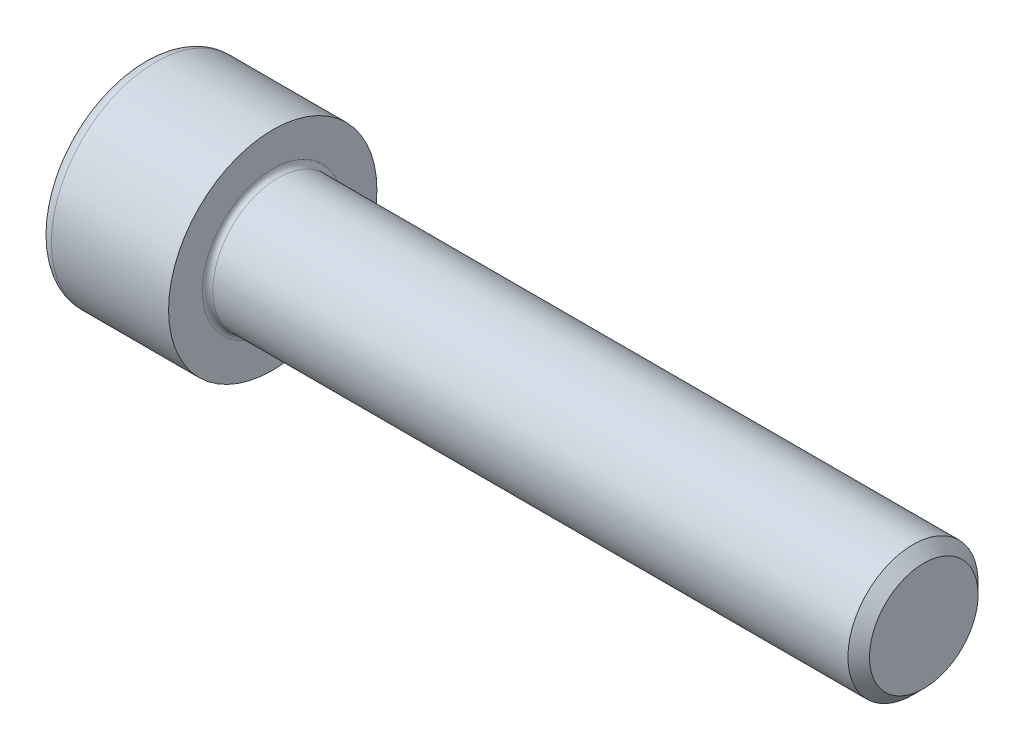
ISO-10303-21;
HEADER;
FILE_DESCRIPTION(('STEP AP214'),'2;1');
FILE_NAME('part.step','',(''),(''),'','','');
FILE_SCHEMA(('AUTOMOTIVE_DESIGN { 1 0 10303 214 1 1 1 1 }'));
ENDSEC;
DATA;
#1=APPLICATION_CONTEXT('core data for automotive mechanical design processes');
#2=APPLICATION_PROTOCOL_DEFINITION('international standard','automotive_design',2000,#1);
#3=PRODUCT_CONTEXT('',#1,'mechanical');
#4=PRODUCT('Part','Part','',(#3));
#5=PRODUCT_RELATED_PRODUCT_CATEGORY('part','',(#4));
#6=PRODUCT_DEFINITION_FORMATION('','',#4);
#7=PRODUCT_DEFINITION_CONTEXT('part definition',#1,'design');
#8=PRODUCT_DEFINITION('design','',#6,#7);
#9=PRODUCT_DEFINITION_SHAPE('','',#8);
#10=(LENGTH_UNIT() NAMED_UNIT(*) SI_UNIT(.MILLI.,.METRE.));
#11=(NAMED_UNIT(*) PLANE_ANGLE_UNIT() SI_UNIT($,.RADIAN.));
#12=(NAMED_UNIT(*) SI_UNIT($,.STERADIAN.) SOLID_ANGLE_UNIT());
#13=UNCERTAINTY_MEASURE_WITH_UNIT(LENGTH_MEASURE(1.E-05),#10,'distance_accuracy_value','');
#14=(GEOMETRIC_REPRESENTATION_CONTEXT(3) GLOBAL_UNCERTAINTY_ASSIGNED_CONTEXT((#13)) GLOBAL_UNIT_ASSIGNED_CONTEXT((#10,
#11,#12)) REPRESENTATION_CONTEXT('',''));
#15=CARTESIAN_POINT('',(0.,0.,0.));
#16=DIRECTION('',(0.,0.,1.));
#17=DIRECTION('',(1.,0.,0.));
#18=AXIS2_PLACEMENT_3D('',#15,#16,#17);
#19=CARTESIAN_POINT('',(0.,0.,0.));
#20=DIRECTION('',(-1.,0.,0.));
#21=DIRECTION('',(0.,0.,1.));
#22=AXIS2_PLACEMENT_3D('',#19,#20,#21);
#23=PLANE('',#22);
#24=DIRECTION('',(0.,-0.499999999999999,0.866025403784439));
#25=VECTOR('',#24,1.);
#26=CARTESIAN_POINT('',(0.,4.63323591024674,0.));
#27=LINE('',#26,#25);
#28=CARTESIAN_POINT('',(0.,4.63323591024674,0.));
#29=VERTEX_POINT('',#28);
#30=CARTESIAN_POINT('',(0.,2.31661795512338,4.01249999999999));
#31=VERTEX_POINT('',#30);
#32=EDGE_CURVE('E287',#29,#31,#27,.T.);
#33=ORIENTED_EDGE('',*,*,#32,.T.);
#34=DIRECTION('',(0.,1.,0.));
#35=VECTOR('',#34,1.);
#36=CARTESIAN_POINT('',(0.,-2.31661795512337,4.0125));
#37=LINE('',#36,#35);
#38=CARTESIAN_POINT('',(0.,-2.31661795512337,4.0125));
#39=VERTEX_POINT('',#38);
#40=EDGE_CURVE('E141',#39,#31,#37,.T.);
#41=ORIENTED_EDGE('',*,*,#40,.F.);
#42=DIRECTION('',(0.,-0.500000000000001,-0.866025403784438));
#43=VECTOR('',#42,1.);
#44=CARTESIAN_POINT('',(0.,-2.31661795512337,4.0125));
#45=LINE('',#44,#43);
#46=CARTESIAN_POINT('',(0.,-4.63323591024675,0.));
#47=VERTEX_POINT('',#46);
#48=EDGE_CURVE('E292',#39,#47,#45,.T.);
#49=ORIENTED_EDGE('',*,*,#48,.T.);
#50=DIRECTION('',(0.,0.499999999999998,-0.86602540378444));
#51=VECTOR('',#50,1.);
#52=CARTESIAN_POINT('',(0.,-4.63323591024675,0.));
#53=LINE('',#52,#51);
#54=CARTESIAN_POINT('',(0.,-2.31661795512338,-4.0125));
#55=VERTEX_POINT('',#54);
#56=EDGE_CURVE('E296',#47,#55,#53,.T.);
#57=ORIENTED_EDGE('',*,*,#56,.T.);
#58=DIRECTION('',(0.,-1.,0.));
#59=VECTOR('',#58,1.);
#60=CARTESIAN_POINT('',(0.,2.31661795512336,-4.0125));
#61=LINE('',#60,#59);
#62=CARTESIAN_POINT('',(0.,2.31661795512336,-4.0125));
#63=VERTEX_POINT('',#62);
#64=EDGE_CURVE('E300',#63,#55,#61,.T.);
#65=ORIENTED_EDGE('',*,*,#64,.F.);
#66=DIRECTION('',(0.,-0.500000000000001,-0.866025403784438));
#67=VECTOR('',#66,1.);
#68=CARTESIAN_POINT('',(0.,4.63323591024674,0.));
#69=LINE('',#68,#67);
#70=EDGE_CURVE('E136',#29,#63,#69,.T.);
#71=ORIENTED_EDGE('',*,*,#70,.F.);
#72=EDGE_LOOP('',(#33,#41,#49,#57,#65,#71));
#73=FACE_BOUND('',#72,.T.);
#74=CARTESIAN_POINT('',(0.,0.,0.));
#75=DIRECTION('',(-1.,0.,0.));
#76=DIRECTION('',(0.,0.,1.));
#77=AXIS2_PLACEMENT_3D('',#74,#75,#76);
#78=CIRCLE('',#77,7.);
#79=CARTESIAN_POINT('',(0.,0.,7.));
#80=VERTEX_POINT('',#79);
#81=EDGE_CURVE('E51',#80,#80,#78,.T.);
#82=ORIENTED_EDGE('',*,*,#81,.T.);
#83=EDGE_LOOP('',(#82));
#84=FACE_BOUND('',#83,.T.);
#85=ADVANCED_FACE('F42',(#73,#84),#23,.T.);
#86=CARTESIAN_POINT('',(-31.75,0.,0.));
#87=DIRECTION('',(-1.,0.,0.));
#88=DIRECTION('',(0.,0.,1.));
#89=AXIS2_PLACEMENT_3D('',#86,#87,#88);
#90=CYLINDRICAL_SURFACE('',#89,8.);
#91=CARTESIAN_POINT('',(1.,0.,0.));
#92=DIRECTION('',(-1.,0.,0.));
#93=DIRECTION('',(0.,0.,1.));
#94=AXIS2_PLACEMENT_3D('',#91,#92,#93);
#95=CIRCLE('',#94,8.);
#96=CARTESIAN_POINT('',(1.,0.,8.));
#97=VERTEX_POINT('',#96);
#98=EDGE_CURVE('E11',#97,#97,#95,.F.);
#99=ORIENTED_EDGE('',*,*,#98,.T.);
#100=EDGE_LOOP('',(#99));
#101=FACE_BOUND('',#100,.T.);
#102=CARTESIAN_POINT('',(10.,0.,0.));
#103=DIRECTION('',(-1.,0.,0.));
#104=DIRECTION('',(0.,0.,1.));
#105=AXIS2_PLACEMENT_3D('',#102,#103,#104);
#106=CIRCLE('',#105,8.);
#107=CARTESIAN_POINT('',(10.,0.,8.));
#108=VERTEX_POINT('',#107);
#109=EDGE_CURVE('E166',#108,#108,#106,.T.);
#110=ORIENTED_EDGE('',*,*,#109,.T.);
#111=EDGE_LOOP('',(#110));
#112=FACE_BOUND('',#111,.T.);
#113=ADVANCED_FACE('F195',(#101,#112),#90,.T.);
#114=CARTESIAN_POINT('',(10.,8.,0.));
#115=DIRECTION('',(1.,0.,0.));
#116=DIRECTION('',(0.,0.,-1.));
#117=AXIS2_PLACEMENT_3D('',#114,#115,#116);
#118=PLANE('',#117);
#119=CARTESIAN_POINT('',(10.,0.,0.));
#120=DIRECTION('',(1.,0.,0.));
#121=DIRECTION('',(0.,0.,-1.));
#122=AXIS2_PLACEMENT_3D('',#119,#120,#121);
#123=CIRCLE('',#122,5.39999999999996);
#124=CARTESIAN_POINT('',(10.,0.,-5.39999999999996));
#125=VERTEX_POINT('',#124);
#126=EDGE_CURVE('E170',#125,#125,#123,.F.);
#127=ORIENTED_EDGE('',*,*,#126,.T.);
#128=EDGE_LOOP('',(#127));
#129=FACE_BOUND('',#128,.T.);
#130=ORIENTED_EDGE('',*,*,#109,.F.);
#131=EDGE_LOOP('',(#130));
#132=FACE_BOUND('',#131,.T.);
#133=ADVANCED_FACE('F201',(#129,#132),#118,.T.);
#134=CARTESIAN_POINT('',(-31.75,0.,0.));
#135=DIRECTION('',(-1.,0.,0.));
#136=DIRECTION('',(0.,0.,1.));
#137=AXIS2_PLACEMENT_3D('',#134,#135,#136);
#138=CYLINDRICAL_SURFACE('',#137,4.99999999999996);
#139=CARTESIAN_POINT('',(10.4,0.,0.));
#140=DIRECTION('',(1.,0.,0.));
#141=DIRECTION('',(0.,0.,-1.));
#142=AXIS2_PLACEMENT_3D('',#139,#140,#141);
#143=CIRCLE('',#142,4.99999999999996);
#144=CARTESIAN_POINT('',(10.4,0.,-4.99999999999996));
#145=VERTEX_POINT('',#144);
#146=EDGE_CURVE('E174',#145,#145,#143,.T.);
#147=ORIENTED_EDGE('',*,*,#146,.T.);
#148=EDGE_LOOP('',(#147));
#149=FACE_BOUND('',#148,.T.);
#150=CARTESIAN_POINT('',(59.1719999999999,0.,0.));
#151=DIRECTION('',(-1.,0.,0.));
#152=DIRECTION('',(0.,0.,1.));
#153=AXIS2_PLACEMENT_3D('',#150,#151,#152);
#154=CIRCLE('',#153,4.99999999999991);
#155=CARTESIAN_POINT('',(59.1719999999999,0.,4.99999999999991));
#156=VERTEX_POINT('',#155);
#157=EDGE_CURVE('E162',#156,#156,#154,.T.);
#158=ORIENTED_EDGE('',*,*,#157,.T.);
#159=EDGE_LOOP('',(#158));
#160=FACE_BOUND('',#159,.T.);
#161=ADVANCED_FACE('F207',(#149,#160),#138,.T.);
#162=CARTESIAN_POINT('',(60.,0.,0.));
#163=DIRECTION('',(-1.,0.,0.));
#164=DIRECTION('',(0.,0.,1.));
#165=AXIS2_PLACEMENT_3D('',#162,#163,#164);
#166=CONICAL_SURFACE('',#165,4.172,0.785398163397348);
#167=ORIENTED_EDGE('',*,*,#157,.F.);
#168=EDGE_LOOP('',(#167));
#169=FACE_BOUND('',#168,.T.);
#170=CARTESIAN_POINT('',(60.,0.,0.));
#171=DIRECTION('',(-1.,0.,0.));
#172=DIRECTION('',(0.,0.,1.));
#173=AXIS2_PLACEMENT_3D('',#170,#171,#172);
#174=CIRCLE('',#173,4.172);
#175=CARTESIAN_POINT('',(60.,0.,4.172));
#176=VERTEX_POINT('',#175);
#177=EDGE_CURVE('E157',#176,#176,#174,.T.);
#178=ORIENTED_EDGE('',*,*,#177,.T.);
#179=EDGE_LOOP('',(#178));
#180=FACE_BOUND('',#179,.T.);
#181=ADVANCED_FACE('F211',(#169,#180),#166,.T.);
#182=CARTESIAN_POINT('',(60.,4.172,0.));
#183=DIRECTION('',(1.,0.,0.));
#184=DIRECTION('',(0.,0.,-1.));
#185=AXIS2_PLACEMENT_3D('',#182,#183,#184);
#186=PLANE('',#185);
#187=ORIENTED_EDGE('',*,*,#177,.F.);
#188=EDGE_LOOP('',(#187));
#189=FACE_BOUND('',#188,.T.);
#190=ADVANCED_FACE('F191',(#189),#186,.T.);
#191=CARTESIAN_POINT('',(10.4,0.,0.));
#192=DIRECTION('',(1.,0.,0.));
#193=DIRECTION('',(0.,0.,-1.));
#194=AXIS2_PLACEMENT_3D('',#191,#192,#193);
#195=TOROIDAL_SURFACE('',#194,5.39999999999996,0.4);
#196=ORIENTED_EDGE('',*,*,#146,.F.);
#197=EDGE_LOOP('',(#196));
#198=FACE_BOUND('',#197,.T.);
#199=ORIENTED_EDGE('',*,*,#126,.F.);
#200=EDGE_LOOP('',(#199));
#201=FACE_BOUND('',#200,.T.);
#202=ADVANCED_FACE('F184',(#198,#201),#195,.F.);
#203=CARTESIAN_POINT('',(1.,0.,0.));
#204=DIRECTION('',(-1.,0.,0.));
#205=DIRECTION('',(0.,0.,1.));
#206=AXIS2_PLACEMENT_3D('',#203,#204,#205);
#207=TOROIDAL_SURFACE('',#206,7.,1.);
#208=ORIENTED_EDGE('',*,*,#98,.F.);
#209=EDGE_LOOP('',(#208));
#210=FACE_BOUND('',#209,.T.);
#211=ORIENTED_EDGE('',*,*,#81,.F.);
#212=EDGE_LOOP('',(#211));
#213=FACE_BOUND('',#212,.T.);
#214=ADVANCED_FACE('F44',(#210,#213),#207,.T.);
#215=CARTESIAN_POINT('',(5.,4.63323591024674,0.));
#216=DIRECTION('',(0.,-0.866025403784439,-0.499999999999999));
#217=DIRECTION('',(0.,0.499999999999999,-0.866025403784439));
#218=AXIS2_PLACEMENT_3D('',#215,#216,#217);
#219=PLANE('',#218);
#220=ORIENTED_EDGE('',*,*,#32,.F.);
#221=DIRECTION('',(-1.,0.,0.));
#222=VECTOR('',#221,1.);
#223=CARTESIAN_POINT('',(5.,4.63323591024674,0.));
#224=LINE('',#223,#222);
#225=CARTESIAN_POINT('',(5.,4.63323591024674,0.));
#226=VERTEX_POINT('',#225);
#227=EDGE_CURVE('E273',#226,#29,#224,.T.);
#228=ORIENTED_EDGE('',*,*,#227,.F.);
#229=DIRECTION('',(0.,-0.499999999999999,0.866025403784439));
#230=VECTOR('',#229,1.);
#231=CARTESIAN_POINT('',(5.,4.63323591024674,0.));
#232=LINE('',#231,#230);
#233=CARTESIAN_POINT('',(5.,3.47492693268506,2.00624999999999));
#234=VERTEX_POINT('',#233);
#235=EDGE_CURVE('E127',#226,#234,#232,.T.);
#236=ORIENTED_EDGE('',*,*,#235,.T.);
#237=CARTESIAN_POINT('',(5.,2.31661795512338,4.01249999999999));
#238=VERTEX_POINT('',#237);
#239=EDGE_CURVE('E117',#234,#238,#232,.T.);
#240=ORIENTED_EDGE('',*,*,#239,.T.);
#241=DIRECTION('',(-1.,0.,0.));
#242=VECTOR('',#241,1.);
#243=CARTESIAN_POINT('',(5.,2.31661795512338,4.01249999999999));
#244=LINE('',#243,#242);
#245=EDGE_CURVE('E132',#238,#31,#244,.T.);
#246=ORIENTED_EDGE('',*,*,#245,.T.);
#247=EDGE_LOOP('',(#220,#228,#236,#240,#246));
#248=FACE_BOUND('',#247,.T.);
#249=ADVANCED_FACE('F131',(#248),#219,.T.);
#250=CARTESIAN_POINT('',(5.,-2.31661795512337,4.0125));
#251=DIRECTION('',(0.,0.,1.));
#252=DIRECTION('',(0.,-1.,0.));
#253=AXIS2_PLACEMENT_3D('',#250,#251,#252);
#254=PLANE('',#253);
#255=ORIENTED_EDGE('',*,*,#40,.T.);
#256=ORIENTED_EDGE('',*,*,#245,.F.);
#257=DIRECTION('',(0.,1.,0.));
#258=VECTOR('',#257,1.);
#259=CARTESIAN_POINT('',(5.,-2.31661795512337,4.0125));
#260=LINE('',#259,#258);
#261=CARTESIAN_POINT('',(5.,0.,4.0125));
#262=VERTEX_POINT('',#261);
#263=EDGE_CURVE('E114',#262,#238,#260,.T.);
#264=ORIENTED_EDGE('',*,*,#263,.F.);
#265=CARTESIAN_POINT('',(5.,-2.31661795512337,4.0125));
#266=VERTEX_POINT('',#265);
#267=EDGE_CURVE('E126',#266,#262,#260,.T.);
#268=ORIENTED_EDGE('',*,*,#267,.F.);
#269=DIRECTION('',(-1.,0.,0.));
#270=VECTOR('',#269,1.);
#271=CARTESIAN_POINT('',(5.,-2.31661795512337,4.0125));
#272=LINE('',#271,#270);
#273=EDGE_CURVE('E144',#266,#39,#272,.T.);
#274=ORIENTED_EDGE('',*,*,#273,.T.);
#275=EDGE_LOOP('',(#255,#256,#264,#268,#274));
#276=FACE_BOUND('',#275,.T.);
#277=ADVANCED_FACE('F138',(#276),#254,.F.);
#278=CARTESIAN_POINT('',(5.,-2.31661795512337,4.0125));
#279=DIRECTION('',(0.,0.866025403784438,-0.500000000000001));
#280=DIRECTION('',(0.,0.500000000000001,0.866025403784438));
#281=AXIS2_PLACEMENT_3D('',#278,#279,#280);
#282=PLANE('',#281);
#283=ORIENTED_EDGE('',*,*,#48,.F.);
#284=ORIENTED_EDGE('',*,*,#273,.F.);
#285=DIRECTION('',(0.,-0.500000000000001,-0.866025403784438));
#286=VECTOR('',#285,1.);
#287=CARTESIAN_POINT('',(5.,-2.31661795512337,4.0125));
#288=LINE('',#287,#286);
#289=CARTESIAN_POINT('',(5.,-3.47492693268506,2.00625));
#290=VERTEX_POINT('',#289);
#291=EDGE_CURVE('E335',#266,#290,#288,.T.);
#292=ORIENTED_EDGE('',*,*,#291,.T.);
#293=CARTESIAN_POINT('',(5.,-4.63323591024675,0.));
#294=VERTEX_POINT('',#293);
#295=EDGE_CURVE('E315',#290,#294,#288,.T.);
#296=ORIENTED_EDGE('',*,*,#295,.T.);
#297=DIRECTION('',(-1.,0.,0.));
#298=VECTOR('',#297,1.);
#299=CARTESIAN_POINT('',(5.,-4.63323591024675,0.));
#300=LINE('',#299,#298);
#301=EDGE_CURVE('E152',#294,#47,#300,.T.);
#302=ORIENTED_EDGE('',*,*,#301,.T.);
#303=EDGE_LOOP('',(#283,#284,#292,#296,#302));
#304=FACE_BOUND('',#303,.T.);
#305=ADVANCED_FACE('F225',(#304),#282,.T.);
#306=CARTESIAN_POINT('',(5.,-4.63323591024675,0.));
#307=DIRECTION('',(0.,0.86602540378444,0.499999999999998));
#308=DIRECTION('',(0.,-0.499999999999998,0.86602540378444));
#309=AXIS2_PLACEMENT_3D('',#306,#307,#308);
#310=PLANE('',#309);
#311=ORIENTED_EDGE('',*,*,#56,.F.);
#312=ORIENTED_EDGE('',*,*,#301,.F.);
#313=DIRECTION('',(0.,0.499999999999998,-0.86602540378444));
#314=VECTOR('',#313,1.);
#315=CARTESIAN_POINT('',(5.,-4.63323591024675,0.));
#316=LINE('',#315,#314);
#317=CARTESIAN_POINT('',(5.,-3.47492693268507,-2.00624999999999));
#318=VERTEX_POINT('',#317);
#319=EDGE_CURVE('E282',#294,#318,#316,.T.);
#320=ORIENTED_EDGE('',*,*,#319,.T.);
#321=CARTESIAN_POINT('',(5.,-2.31661795512338,-4.0125));
#322=VERTEX_POINT('',#321);
#323=EDGE_CURVE('E333',#318,#322,#316,.T.);
#324=ORIENTED_EDGE('',*,*,#323,.T.);
#325=DIRECTION('',(-1.,0.,0.));
#326=VECTOR('',#325,1.);
#327=CARTESIAN_POINT('',(5.,-2.31661795512338,-4.0125));
#328=LINE('',#327,#326);
#329=EDGE_CURVE('E272',#322,#55,#328,.T.);
#330=ORIENTED_EDGE('',*,*,#329,.T.);
#331=EDGE_LOOP('',(#311,#312,#320,#324,#330));
#332=FACE_BOUND('',#331,.T.);
#333=ADVANCED_FACE('F228',(#332),#310,.T.);
#334=CARTESIAN_POINT('',(5.,2.31661795512336,-4.0125));
#335=DIRECTION('',(0.,0.,-1.));
#336=DIRECTION('',(0.,1.,0.));
#337=AXIS2_PLACEMENT_3D('',#334,#335,#336);
#338=PLANE('',#337);
#339=ORIENTED_EDGE('',*,*,#64,.T.);
#340=ORIENTED_EDGE('',*,*,#329,.F.);
#341=DIRECTION('',(0.,-1.,0.));
#342=VECTOR('',#341,1.);
#343=CARTESIAN_POINT('',(5.,2.31661795512336,-4.0125));
#344=LINE('',#343,#342);
#345=CARTESIAN_POINT('',(5.,0.,-4.0125));
#346=VERTEX_POINT('',#345);
#347=EDGE_CURVE('E276',#346,#322,#344,.T.);
#348=ORIENTED_EDGE('',*,*,#347,.F.);
#349=CARTESIAN_POINT('',(5.,2.31661795512336,-4.0125));
#350=VERTEX_POINT('',#349);
#351=EDGE_CURVE('E58',#350,#346,#344,.T.);
#352=ORIENTED_EDGE('',*,*,#351,.F.);
#353=DIRECTION('',(-1.,0.,0.));
#354=VECTOR('',#353,1.);
#355=CARTESIAN_POINT('',(5.,2.31661795512336,-4.0125));
#356=LINE('',#355,#354);
#357=EDGE_CURVE('E268',#350,#63,#356,.T.);
#358=ORIENTED_EDGE('',*,*,#357,.T.);
#359=EDGE_LOOP('',(#339,#340,#348,#352,#358));
#360=FACE_BOUND('',#359,.T.);
#361=ADVANCED_FACE('F232',(#360),#338,.F.);
#362=CARTESIAN_POINT('',(5.,4.63323591024674,0.));
#363=DIRECTION('',(0.,0.866025403784438,-0.500000000000001));
#364=DIRECTION('',(0.,0.500000000000001,0.866025403784438));
#365=AXIS2_PLACEMENT_3D('',#362,#363,#364);
#366=PLANE('',#365);
#367=ORIENTED_EDGE('',*,*,#70,.T.);
#368=ORIENTED_EDGE('',*,*,#357,.F.);
#369=DIRECTION('',(0.,-0.500000000000001,-0.866025403784438));
#370=VECTOR('',#369,1.);
#371=CARTESIAN_POINT('',(5.,4.63323591024674,0.));
#372=LINE('',#371,#370);
#373=CARTESIAN_POINT('',(5.,3.47492693268505,-2.00625));
#374=VERTEX_POINT('',#373);
#375=EDGE_CURVE('E257',#374,#350,#372,.T.);
#376=ORIENTED_EDGE('',*,*,#375,.F.);
#377=EDGE_CURVE('E264',#226,#374,#372,.T.);
#378=ORIENTED_EDGE('',*,*,#377,.F.);
#379=ORIENTED_EDGE('',*,*,#227,.T.);
#380=EDGE_LOOP('',(#367,#368,#376,#378,#379));
#381=FACE_BOUND('',#380,.T.);
#382=ADVANCED_FACE('F236',(#381),#366,.F.);
#383=CARTESIAN_POINT('',(5.,6.94985386537011,-4.01250000000001));
#384=DIRECTION('',(1.,0.,0.));
#385=DIRECTION('',(0.,0.,-1.));
#386=AXIS2_PLACEMENT_3D('',#383,#384,#385);
#387=PLANE('',#386);
#388=ORIENTED_EDGE('',*,*,#347,.T.);
#389=ORIENTED_EDGE('',*,*,#323,.F.);
#390=CARTESIAN_POINT('',(5.,0.,0.));
#391=DIRECTION('',(-1.,0.,0.));
#392=DIRECTION('',(0.,0.,1.));
#393=AXIS2_PLACEMENT_3D('',#390,#391,#392);
#394=CIRCLE('',#393,4.0125);
#395=EDGE_CURVE('E324',#346,#318,#394,.T.);
#396=ORIENTED_EDGE('',*,*,#395,.F.);
#397=EDGE_LOOP('',(#388,#389,#396));
#398=FACE_BOUND('',#397,.T.);
#399=ADVANCED_FACE('F240',(#398),#387,.F.);
#400=ORIENTED_EDGE('',*,*,#319,.F.);
#401=ORIENTED_EDGE('',*,*,#295,.F.);
#402=EDGE_CURVE('E150',#318,#290,#394,.T.);
#403=ORIENTED_EDGE('',*,*,#402,.F.);
#404=EDGE_LOOP('',(#400,#401,#403));
#405=FACE_BOUND('',#404,.T.);
#406=ADVANCED_FACE('F243',(#405),#387,.F.);
#407=ORIENTED_EDGE('',*,*,#291,.F.);
#408=ORIENTED_EDGE('',*,*,#267,.T.);
#409=EDGE_CURVE('E143',#290,#262,#394,.T.);
#410=ORIENTED_EDGE('',*,*,#409,.F.);
#411=EDGE_LOOP('',(#407,#408,#410));
#412=FACE_BOUND('',#411,.T.);
#413=ADVANCED_FACE('F248',(#412),#387,.F.);
#414=ORIENTED_EDGE('',*,*,#263,.T.);
#415=ORIENTED_EDGE('',*,*,#239,.F.);
#416=EDGE_CURVE('E120',#262,#234,#394,.T.);
#417=ORIENTED_EDGE('',*,*,#416,.F.);
#418=EDGE_LOOP('',(#414,#415,#417));
#419=FACE_BOUND('',#418,.T.);
#420=ADVANCED_FACE('F116',(#419),#387,.F.);
#421=ORIENTED_EDGE('',*,*,#235,.F.);
#422=ORIENTED_EDGE('',*,*,#377,.T.);
#423=EDGE_CURVE('E158',#234,#374,#394,.T.);
#424=ORIENTED_EDGE('',*,*,#423,.F.);
#425=EDGE_LOOP('',(#421,#422,#424));
#426=FACE_BOUND('',#425,.T.);
#427=ADVANCED_FACE('F251',(#426),#387,.F.);
#428=ORIENTED_EDGE('',*,*,#375,.T.);
#429=ORIENTED_EDGE('',*,*,#351,.T.);
#430=EDGE_CURVE('E260',#374,#346,#394,.T.);
#431=ORIENTED_EDGE('',*,*,#430,.F.);
#432=EDGE_LOOP('',(#428,#429,#431));
#433=FACE_BOUND('',#432,.T.);
#434=ADVANCED_FACE('F221',(#433),#387,.F.);
#435=CARTESIAN_POINT('',(5.,0.,0.));
#436=DIRECTION('',(-1.,0.,0.));
#437=DIRECTION('',(0.,0.,1.));
#438=AXIS2_PLACEMENT_3D('',#435,#436,#437);
#439=CONICAL_SURFACE('',#438,4.0125,1.04719755119659);
#440=CARTESIAN_POINT('',(7.31661795512339,0.,0.));
#441=VERTEX_POINT('',#440);
#442=VERTEX_LOOP('',#441);
#443=FACE_BOUND('',#442,.T.);
#444=ORIENTED_EDGE('',*,*,#416,.T.);
#445=ORIENTED_EDGE('',*,*,#423,.T.);
#446=ORIENTED_EDGE('',*,*,#430,.T.);
#447=ORIENTED_EDGE('',*,*,#395,.T.);
#448=ORIENTED_EDGE('',*,*,#402,.T.);
#449=ORIENTED_EDGE('',*,*,#409,.T.);
#450=EDGE_LOOP('',(#444,#445,#446,#447,#448,#449));
#451=FACE_BOUND('',#450,.T.);
#452=ADVANCED_FACE('F219',(#443,#451),#439,.F.);
#453=CLOSED_SHELL('',(#85,#113,#133,#161,#181,#190,#202,#214,#249,#277,#305,#333,#361,#382,#399,
#406,#413,#420,#427,#434,#452));
#454=MANIFOLD_SOLID_BREP('B2',#453);
#455=ADVANCED_BREP_SHAPE_REPRESENTATION('',(#18,#454),#14);
#456=SHAPE_DEFINITION_REPRESENTATION(#9,#455);
ENDSEC;
END-ISO-10303-21;
